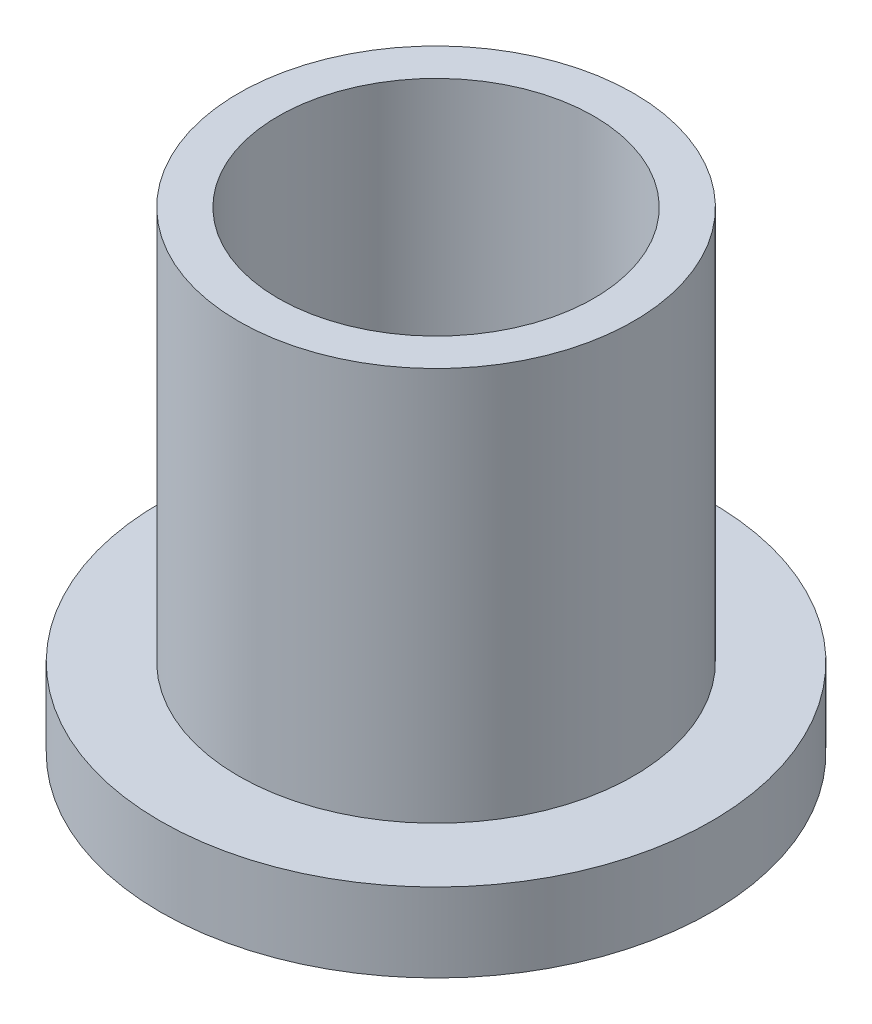
ISO-10303-21;
HEADER;
FILE_DESCRIPTION(('STEP AP214'),'2;1');
FILE_NAME('part.step','',(''),(''),'','','');
FILE_SCHEMA(('AUTOMOTIVE_DESIGN { 1 0 10303 214 1 1 1 1 }'));
ENDSEC;
DATA;
#1=APPLICATION_CONTEXT('core data for automotive mechanical design processes');
#2=APPLICATION_PROTOCOL_DEFINITION('international standard','automotive_design',2000,#1);
#3=PRODUCT_CONTEXT('',#1,'mechanical');
#4=PRODUCT('Part','Part','',(#3));
#5=PRODUCT_RELATED_PRODUCT_CATEGORY('part','',(#4));
#6=PRODUCT_DEFINITION_FORMATION('','',#4);
#7=PRODUCT_DEFINITION_CONTEXT('part definition',#1,'design');
#8=PRODUCT_DEFINITION('design','',#6,#7);
#9=PRODUCT_DEFINITION_SHAPE('','',#8);
#10=(LENGTH_UNIT() NAMED_UNIT(*) SI_UNIT(.MILLI.,.METRE.));
#11=(NAMED_UNIT(*) PLANE_ANGLE_UNIT() SI_UNIT($,.RADIAN.));
#12=(NAMED_UNIT(*) SI_UNIT($,.STERADIAN.) SOLID_ANGLE_UNIT());
#13=UNCERTAINTY_MEASURE_WITH_UNIT(LENGTH_MEASURE(1.E-05),#10,'distance_accuracy_value','');
#14=(GEOMETRIC_REPRESENTATION_CONTEXT(3) GLOBAL_UNCERTAINTY_ASSIGNED_CONTEXT((#13)) GLOBAL_UNIT_ASSIGNED_CONTEXT((#10,
#11,#12)) REPRESENTATION_CONTEXT('',''));
#15=CARTESIAN_POINT('',(0.,0.,0.));
#16=DIRECTION('',(0.,0.,1.));
#17=DIRECTION('',(1.,0.,0.));
#18=AXIS2_PLACEMENT_3D('',#15,#16,#17);
#19=CARTESIAN_POINT('',(0.,19.05,0.));
#20=DIRECTION('',(0.,1.,0.));
#21=DIRECTION('',(0.,0.,1.));
#22=AXIS2_PLACEMENT_3D('',#19,#20,#21);
#23=PLANE('',#22);
#24=CARTESIAN_POINT('',(0.,19.05,0.));
#25=DIRECTION('',(0.,1.,0.));
#26=DIRECTION('',(0.,0.,1.));
#27=AXIS2_PLACEMENT_3D('',#24,#25,#26);
#28=CIRCLE('',#27,7.9629);
#29=CARTESIAN_POINT('',(0.,19.05,7.9629));
#30=VERTEX_POINT('',#29);
#31=EDGE_CURVE('E10',#30,#30,#28,.T.);
#32=ORIENTED_EDGE('',*,*,#31,.T.);
#33=EDGE_LOOP('',(#32));
#34=FACE_BOUND('',#33,.T.);
#35=CARTESIAN_POINT('',(0.,19.05,0.));
#36=DIRECTION('',(0.,1.,0.));
#37=DIRECTION('',(0.,0.,1.));
#38=AXIS2_PLACEMENT_3D('',#35,#36,#37);
#39=CIRCLE('',#38,6.3627);
#40=CARTESIAN_POINT('',(0.,19.05,6.3627));
#41=VERTEX_POINT('',#40);
#42=EDGE_CURVE('E38',#41,#41,#39,.T.);
#43=ORIENTED_EDGE('',*,*,#42,.F.);
#44=EDGE_LOOP('',(#43));
#45=FACE_BOUND('',#44,.T.);
#46=ADVANCED_FACE('F31',(#34,#45),#23,.T.);
#47=CARTESIAN_POINT('',(0.,0.,0.));
#48=DIRECTION('',(0.,1.,0.));
#49=DIRECTION('',(0.,0.,1.));
#50=AXIS2_PLACEMENT_3D('',#47,#48,#49);
#51=PLANE('',#50);
#52=CARTESIAN_POINT('',(0.,0.,0.));
#53=DIRECTION('',(0.,1.,0.));
#54=DIRECTION('',(0.,0.,1.));
#55=AXIS2_PLACEMENT_3D('',#52,#53,#54);
#56=CIRCLE('',#55,6.3627);
#57=CARTESIAN_POINT('',(0.,0.,6.3627));
#58=VERTEX_POINT('',#57);
#59=EDGE_CURVE('E42',#58,#58,#56,.T.);
#60=ORIENTED_EDGE('',*,*,#59,.T.);
#61=EDGE_LOOP('',(#60));
#62=FACE_BOUND('',#61,.T.);
#63=CARTESIAN_POINT('',(0.,0.,0.));
#64=DIRECTION('',(0.,1.,0.));
#65=DIRECTION('',(0.,0.,1.));
#66=AXIS2_PLACEMENT_3D('',#63,#64,#65);
#67=CIRCLE('',#66,11.1125);
#68=CARTESIAN_POINT('',(0.,0.,11.1125));
#69=VERTEX_POINT('',#68);
#70=EDGE_CURVE('E49',#69,#69,#67,.T.);
#71=ORIENTED_EDGE('',*,*,#70,.F.);
#72=EDGE_LOOP('',(#71));
#73=FACE_BOUND('',#72,.T.);
#74=ADVANCED_FACE('F74',(#62,#73),#51,.F.);
#75=CARTESIAN_POINT('',(0.,19.05,0.));
#76=DIRECTION('',(0.,-1.,0.));
#77=DIRECTION('',(0.,0.,-1.));
#78=AXIS2_PLACEMENT_3D('',#75,#76,#77);
#79=CYLINDRICAL_SURFACE('',#78,7.9629);
#80=CARTESIAN_POINT('',(0.,3.175,0.));
#81=DIRECTION('',(0.,1.,0.));
#82=DIRECTION('',(0.,0.,1.));
#83=AXIS2_PLACEMENT_3D('',#80,#81,#82);
#84=CIRCLE('',#83,7.9629);
#85=CARTESIAN_POINT('',(0.,3.175,7.9629));
#86=VERTEX_POINT('',#85);
#87=EDGE_CURVE('E52',#86,#86,#84,.T.);
#88=ORIENTED_EDGE('',*,*,#87,.T.);
#89=EDGE_LOOP('',(#88));
#90=FACE_BOUND('',#89,.T.);
#91=ORIENTED_EDGE('',*,*,#31,.F.);
#92=EDGE_LOOP('',(#91));
#93=FACE_BOUND('',#92,.T.);
#94=ADVANCED_FACE('F33',(#90,#93),#79,.T.);
#95=CARTESIAN_POINT('',(0.,19.05,0.));
#96=DIRECTION('',(0.,-1.,0.));
#97=DIRECTION('',(0.,0.,-1.));
#98=AXIS2_PLACEMENT_3D('',#95,#96,#97);
#99=CYLINDRICAL_SURFACE('',#98,6.3627);
#100=ORIENTED_EDGE('',*,*,#42,.T.);
#101=EDGE_LOOP('',(#100));
#102=FACE_BOUND('',#101,.T.);
#103=ORIENTED_EDGE('',*,*,#59,.F.);
#104=EDGE_LOOP('',(#103));
#105=FACE_BOUND('',#104,.T.);
#106=ADVANCED_FACE('F63',(#102,#105),#99,.F.);
#107=CARTESIAN_POINT('',(0.,3.175,0.));
#108=DIRECTION('',(0.,1.,0.));
#109=DIRECTION('',(0.,0.,1.));
#110=AXIS2_PLACEMENT_3D('',#107,#108,#109);
#111=PLANE('',#110);
#112=CARTESIAN_POINT('',(0.,3.175,0.));
#113=DIRECTION('',(0.,1.,0.));
#114=DIRECTION('',(0.,0.,1.));
#115=AXIS2_PLACEMENT_3D('',#112,#113,#114);
#116=CIRCLE('',#115,11.1125);
#117=CARTESIAN_POINT('',(0.,3.175,11.1125));
#118=VERTEX_POINT('',#117);
#119=EDGE_CURVE('E47',#118,#118,#116,.T.);
#120=ORIENTED_EDGE('',*,*,#119,.T.);
#121=EDGE_LOOP('',(#120));
#122=FACE_BOUND('',#121,.T.);
#123=ORIENTED_EDGE('',*,*,#87,.F.);
#124=EDGE_LOOP('',(#123));
#125=FACE_BOUND('',#124,.T.);
#126=ADVANCED_FACE('F60',(#122,#125),#111,.T.);
#127=CARTESIAN_POINT('',(0.,3.175,0.));
#128=DIRECTION('',(0.,-1.,0.));
#129=DIRECTION('',(0.,0.,-1.));
#130=AXIS2_PLACEMENT_3D('',#127,#128,#129);
#131=CYLINDRICAL_SURFACE('',#130,11.1125);
#132=ORIENTED_EDGE('',*,*,#119,.F.);
#133=EDGE_LOOP('',(#132));
#134=FACE_BOUND('',#133,.T.);
#135=ORIENTED_EDGE('',*,*,#70,.T.);
#136=EDGE_LOOP('',(#135));
#137=FACE_BOUND('',#136,.T.);
#138=ADVANCED_FACE('F62',(#134,#137),#131,.T.);
#139=CLOSED_SHELL('',(#46,#74,#94,#106,#126,#138));
#140=MANIFOLD_SOLID_BREP('B2',#139);
#141=ADVANCED_BREP_SHAPE_REPRESENTATION('',(#18,#140),#14);
#142=SHAPE_DEFINITION_REPRESENTATION(#9,#141);
ENDSEC;
END-ISO-10303-21;
